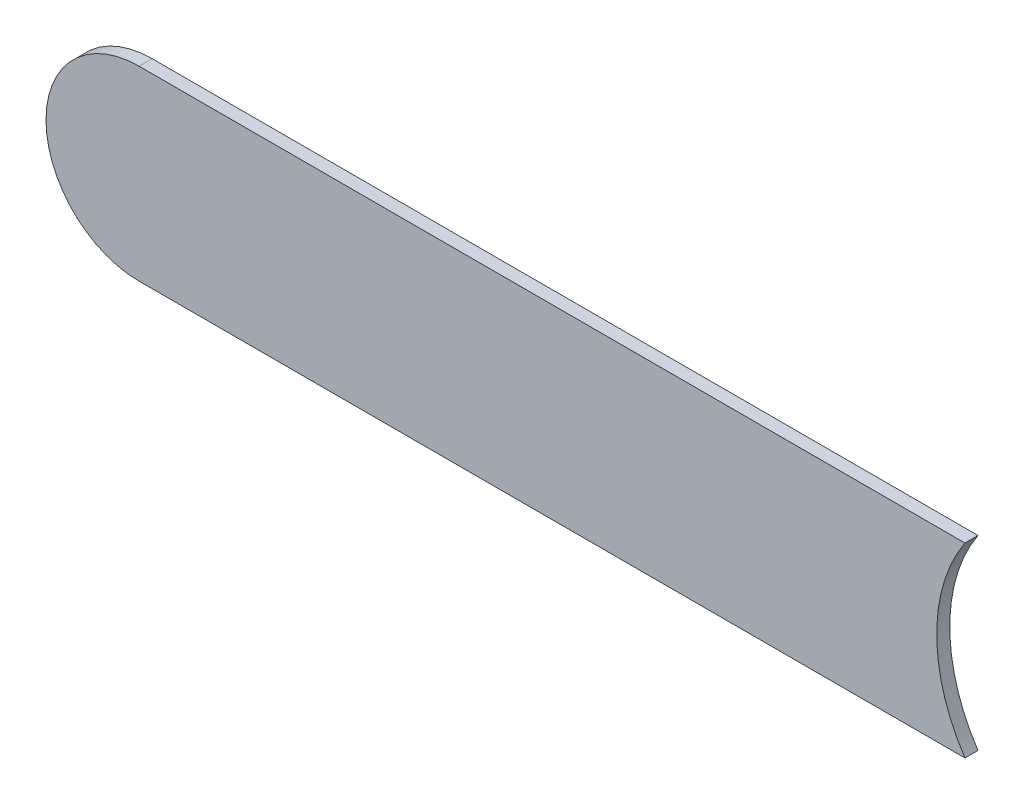
ISO-10303-21;
HEADER;
FILE_DESCRIPTION(('STEP AP214'),'2;1');
FILE_NAME('part.step','',(''),(''),'','','');
FILE_SCHEMA(('AUTOMOTIVE_DESIGN { 1 0 10303 214 1 1 1 1 }'));
ENDSEC;
DATA;
#1=APPLICATION_CONTEXT('core data for automotive mechanical design processes');
#2=APPLICATION_PROTOCOL_DEFINITION('international standard','automotive_design',2000,#1);
#3=PRODUCT_CONTEXT('',#1,'mechanical');
#4=PRODUCT('Part','Part','',(#3));
#5=PRODUCT_RELATED_PRODUCT_CATEGORY('part','',(#4));
#6=PRODUCT_DEFINITION_FORMATION('','',#4);
#7=PRODUCT_DEFINITION_CONTEXT('part definition',#1,'design');
#8=PRODUCT_DEFINITION('design','',#6,#7);
#9=PRODUCT_DEFINITION_SHAPE('','',#8);
#10=(LENGTH_UNIT() NAMED_UNIT(*) SI_UNIT(.MILLI.,.METRE.));
#11=(NAMED_UNIT(*) PLANE_ANGLE_UNIT() SI_UNIT($,.RADIAN.));
#12=(NAMED_UNIT(*) SI_UNIT($,.STERADIAN.) SOLID_ANGLE_UNIT());
#13=UNCERTAINTY_MEASURE_WITH_UNIT(LENGTH_MEASURE(1.E-05),#10,'distance_accuracy_value','');
#14=(GEOMETRIC_REPRESENTATION_CONTEXT(3) GLOBAL_UNCERTAINTY_ASSIGNED_CONTEXT((#13)) GLOBAL_UNIT_ASSIGNED_CONTEXT((#10,
#11,#12)) REPRESENTATION_CONTEXT('',''));
#15=CARTESIAN_POINT('',(0.,0.,0.));
#16=DIRECTION('',(0.,0.,1.));
#17=DIRECTION('',(1.,0.,0.));
#18=AXIS2_PLACEMENT_3D('',#15,#16,#17);
#19=CARTESIAN_POINT('',(177.26,-129.206,-0.035));
#20=DIRECTION('',(0.,-1.,0.));
#21=DIRECTION('',(0.,0.,-1.));
#22=AXIS2_PLACEMENT_3D('',#19,#20,#21);
#23=PLANE('',#22);
#24=DIRECTION('',(0.,0.,1.));
#25=VECTOR('',#24,1.);
#26=CARTESIAN_POINT('',(174.668,-129.206,-0.035));
#27=LINE('',#26,#25);
#28=CARTESIAN_POINT('',(174.668,-129.206,-0.035));
#29=VERTEX_POINT('',#28);
#30=CARTESIAN_POINT('',(174.668,-129.206,0.));
#31=VERTEX_POINT('',#30);
#32=EDGE_CURVE('E11',#29,#31,#27,.T.);
#33=ORIENTED_EDGE('',*,*,#32,.T.);
#34=DIRECTION('',(-1.,0.,0.));
#35=VECTOR('',#34,1.);
#36=CARTESIAN_POINT('',(177.26,-129.206,0.));
#37=LINE('',#36,#35);
#38=CARTESIAN_POINT('',(176.8858342613,-129.206,0.));
#39=VERTEX_POINT('',#38);
#40=EDGE_CURVE('E26',#39,#31,#37,.T.);
#41=ORIENTED_EDGE('',*,*,#40,.F.);
#42=DIRECTION('',(0.,0.,-1.));
#43=VECTOR('',#42,1.);
#44=CARTESIAN_POINT('',(176.88583426132,-129.206,-0.045));
#45=LINE('',#44,#43);
#46=CARTESIAN_POINT('',(176.8858342613,-129.206,-0.035));
#47=VERTEX_POINT('',#46);
#48=EDGE_CURVE('E56',#39,#47,#45,.T.);
#49=ORIENTED_EDGE('',*,*,#48,.T.);
#50=DIRECTION('',(-1.,0.,0.));
#51=VECTOR('',#50,1.);
#52=CARTESIAN_POINT('',(177.26,-129.206,-0.035));
#53=LINE('',#52,#51);
#54=EDGE_CURVE('E59',#47,#29,#53,.T.);
#55=ORIENTED_EDGE('',*,*,#54,.T.);
#56=EDGE_LOOP('',(#33,#41,#49,#55));
#57=FACE_BOUND('',#56,.T.);
#58=ADVANCED_FACE('F17',(#57),#23,.F.);
#59=CARTESIAN_POINT('',(174.668,-129.456,-0.035));
#60=DIRECTION('',(0.,0.,-1.));
#61=DIRECTION('',(0.,1.,0.));
#62=AXIS2_PLACEMENT_3D('',#59,#60,#61);
#63=CYLINDRICAL_SURFACE('',#62,0.25);
#64=CARTESIAN_POINT('',(174.668,-129.456,-0.035));
#65=DIRECTION('',(0.,0.,1.));
#66=DIRECTION('',(0.,1.,0.));
#67=AXIS2_PLACEMENT_3D('',#64,#65,#66);
#68=CIRCLE('',#67,0.25);
#69=CARTESIAN_POINT('',(174.668,-129.706,-0.035));
#70=VERTEX_POINT('',#69);
#71=EDGE_CURVE('E77',#29,#70,#68,.T.);
#72=ORIENTED_EDGE('',*,*,#71,.T.);
#73=DIRECTION('',(0.,0.,1.));
#74=VECTOR('',#73,1.);
#75=CARTESIAN_POINT('',(174.668,-129.706,-0.035));
#76=LINE('',#75,#74);
#77=CARTESIAN_POINT('',(174.668,-129.706,0.));
#78=VERTEX_POINT('',#77);
#79=EDGE_CURVE('E88',#70,#78,#76,.T.);
#80=ORIENTED_EDGE('',*,*,#79,.T.);
#81=CARTESIAN_POINT('',(174.668,-129.456,0.));
#82=DIRECTION('',(0.,0.,1.));
#83=DIRECTION('',(0.,1.,0.));
#84=AXIS2_PLACEMENT_3D('',#81,#82,#83);
#85=CIRCLE('',#84,0.25);
#86=EDGE_CURVE('E64',#31,#78,#85,.T.);
#87=ORIENTED_EDGE('',*,*,#86,.F.);
#88=ORIENTED_EDGE('',*,*,#32,.F.);
#89=EDGE_LOOP('',(#72,#80,#87,#88));
#90=FACE_BOUND('',#89,.T.);
#91=ADVANCED_FACE('F19',(#90),#63,.T.);
#92=CARTESIAN_POINT('',(174.668,-129.706,0.));
#93=DIRECTION('',(0.,0.,1.));
#94=DIRECTION('',(1.,0.,0.));
#95=AXIS2_PLACEMENT_3D('',#92,#93,#94);
#96=PLANE('',#95);
#97=ORIENTED_EDGE('',*,*,#86,.T.);
#98=DIRECTION('',(1.,0.,0.));
#99=VECTOR('',#98,1.);
#100=CARTESIAN_POINT('',(174.668,-129.706,0.));
#101=LINE('',#100,#99);
#102=CARTESIAN_POINT('',(176.88583426131,-129.706,0.));
#103=VERTEX_POINT('',#102);
#104=EDGE_CURVE('E103',#78,#103,#101,.T.);
#105=ORIENTED_EDGE('',*,*,#104,.T.);
#106=CARTESIAN_POINT('',(177.26,-129.456,0.));
#107=DIRECTION('',(0.,0.,-1.));
#108=DIRECTION('',(0.,-1.,0.));
#109=AXIS2_PLACEMENT_3D('',#106,#107,#108);
#110=CIRCLE('',#109,0.45);
#111=EDGE_CURVE('E65',#103,#39,#110,.T.);
#112=ORIENTED_EDGE('',*,*,#111,.T.);
#113=ORIENTED_EDGE('',*,*,#40,.T.);
#114=EDGE_LOOP('',(#97,#105,#112,#113));
#115=FACE_BOUND('',#114,.T.);
#116=ADVANCED_FACE('F99',(#115),#96,.T.);
#117=CARTESIAN_POINT('',(177.26,-129.456,-0.045));
#118=DIRECTION('',(0.,0.,-1.));
#119=DIRECTION('',(0.,-1.,0.));
#120=AXIS2_PLACEMENT_3D('',#117,#118,#119);
#121=CYLINDRICAL_SURFACE('',#120,0.45);
#122=ORIENTED_EDGE('',*,*,#111,.F.);
#123=DIRECTION('',(0.,0.,-1.));
#124=VECTOR('',#123,1.);
#125=CARTESIAN_POINT('',(176.88583426132,-129.706,-0.045));
#126=LINE('',#125,#124);
#127=CARTESIAN_POINT('',(176.88583426131,-129.706,-0.035));
#128=VERTEX_POINT('',#127);
#129=EDGE_CURVE('E72',#103,#128,#126,.T.);
#130=ORIENTED_EDGE('',*,*,#129,.T.);
#131=CARTESIAN_POINT('',(177.26,-129.456,-0.035));
#132=DIRECTION('',(0.,0.,-1.));
#133=DIRECTION('',(0.,-1.,0.));
#134=AXIS2_PLACEMENT_3D('',#131,#132,#133);
#135=CIRCLE('',#134,0.45);
#136=EDGE_CURVE('E68',#128,#47,#135,.T.);
#137=ORIENTED_EDGE('',*,*,#136,.T.);
#138=ORIENTED_EDGE('',*,*,#48,.F.);
#139=EDGE_LOOP('',(#122,#130,#137,#138));
#140=FACE_BOUND('',#139,.T.);
#141=ADVANCED_FACE('F69',(#140),#121,.F.);
#142=CARTESIAN_POINT('',(174.668,-129.706,-0.035));
#143=DIRECTION('',(0.,0.,1.));
#144=DIRECTION('',(1.,0.,0.));
#145=AXIS2_PLACEMENT_3D('',#142,#143,#144);
#146=PLANE('',#145);
#147=ORIENTED_EDGE('',*,*,#54,.F.);
#148=ORIENTED_EDGE('',*,*,#136,.F.);
#149=DIRECTION('',(1.,0.,0.));
#150=VECTOR('',#149,1.);
#151=CARTESIAN_POINT('',(174.668,-129.706,-0.035));
#152=LINE('',#151,#150);
#153=EDGE_CURVE('E82',#70,#128,#152,.T.);
#154=ORIENTED_EDGE('',*,*,#153,.F.);
#155=ORIENTED_EDGE('',*,*,#71,.F.);
#156=EDGE_LOOP('',(#147,#148,#154,#155));
#157=FACE_BOUND('',#156,.T.);
#158=ADVANCED_FACE('F80',(#157),#146,.F.);
#159=CARTESIAN_POINT('',(174.668,-129.706,-0.035));
#160=DIRECTION('',(0.,1.,0.));
#161=DIRECTION('',(1.,0.,0.));
#162=AXIS2_PLACEMENT_3D('',#159,#160,#161);
#163=PLANE('',#162);
#164=ORIENTED_EDGE('',*,*,#129,.F.);
#165=ORIENTED_EDGE('',*,*,#104,.F.);
#166=ORIENTED_EDGE('',*,*,#79,.F.);
#167=ORIENTED_EDGE('',*,*,#153,.T.);
#168=EDGE_LOOP('',(#164,#165,#166,#167));
#169=FACE_BOUND('',#168,.T.);
#170=ADVANCED_FACE('F119',(#169),#163,.F.);
#171=CLOSED_SHELL('',(#58,#91,#116,#141,#158,#170));
#172=MANIFOLD_SOLID_BREP('B1',#171);
#173=ADVANCED_BREP_SHAPE_REPRESENTATION('',(#18,#172),#14);
#174=SHAPE_DEFINITION_REPRESENTATION(#9,#173);
ENDSEC;
END-ISO-10303-21;
